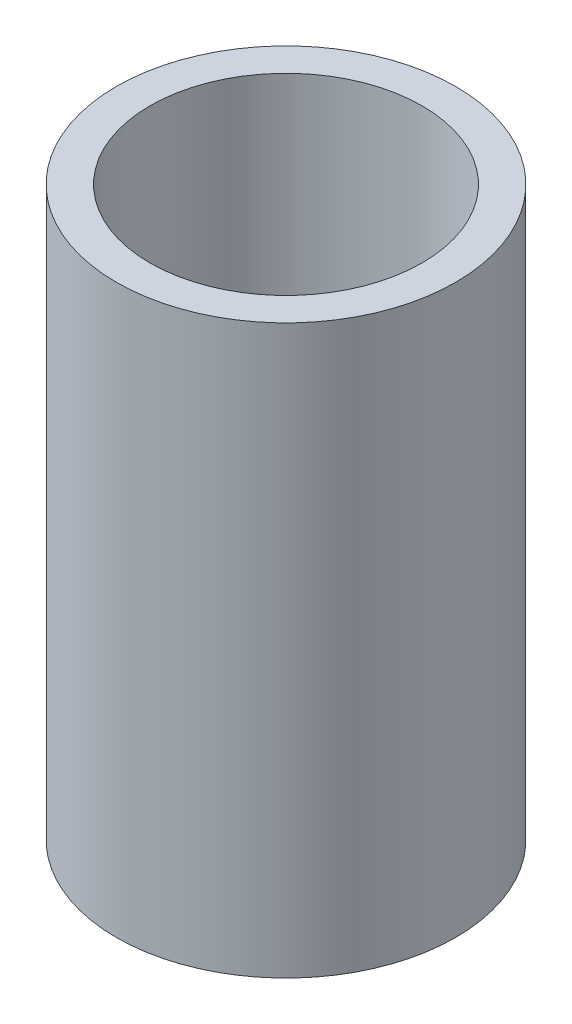
ISO-10303-21;
HEADER;
FILE_DESCRIPTION(('STEP AP214'),'2;1');
FILE_NAME('part.step','',(''),(''),'','','');
FILE_SCHEMA(('AUTOMOTIVE_DESIGN { 1 0 10303 214 1 1 1 1 }'));
ENDSEC;
DATA;
#1=APPLICATION_CONTEXT('core data for automotive mechanical design processes');
#2=APPLICATION_PROTOCOL_DEFINITION('international standard','automotive_design',2000,#1);
#3=PRODUCT_CONTEXT('',#1,'mechanical');
#4=PRODUCT('Part','Part','',(#3));
#5=PRODUCT_RELATED_PRODUCT_CATEGORY('part','',(#4));
#6=PRODUCT_DEFINITION_FORMATION('','',#4);
#7=PRODUCT_DEFINITION_CONTEXT('part definition',#1,'design');
#8=PRODUCT_DEFINITION('design','',#6,#7);
#9=PRODUCT_DEFINITION_SHAPE('','',#8);
#10=(LENGTH_UNIT() NAMED_UNIT(*) SI_UNIT(.MILLI.,.METRE.));
#11=(NAMED_UNIT(*) PLANE_ANGLE_UNIT() SI_UNIT($,.RADIAN.));
#12=(NAMED_UNIT(*) SI_UNIT($,.STERADIAN.) SOLID_ANGLE_UNIT());
#13=UNCERTAINTY_MEASURE_WITH_UNIT(LENGTH_MEASURE(1.E-05),#10,'distance_accuracy_value','');
#14=(GEOMETRIC_REPRESENTATION_CONTEXT(3) GLOBAL_UNCERTAINTY_ASSIGNED_CONTEXT((#13)) GLOBAL_UNIT_ASSIGNED_CONTEXT((#10,
#11,#12)) REPRESENTATION_CONTEXT('',''));
#15=CARTESIAN_POINT('',(0.,0.,0.));
#16=DIRECTION('',(0.,0.,1.));
#17=DIRECTION('',(1.,0.,0.));
#18=AXIS2_PLACEMENT_3D('',#15,#16,#17);
#19=CARTESIAN_POINT('',(0.,58.5398565202642,0.));
#20=DIRECTION('',(0.,-1.,0.));
#21=DIRECTION('',(0.,0.,-1.));
#22=AXIS2_PLACEMENT_3D('',#19,#20,#21);
#23=CYLINDRICAL_SURFACE('',#22,17.5);
#24=CARTESIAN_POINT('',(0.,58.5398565202642,0.));
#25=DIRECTION('',(0.,1.,0.));
#26=DIRECTION('',(0.,0.,1.));
#27=AXIS2_PLACEMENT_3D('',#24,#25,#26);
#28=CIRCLE('',#27,17.5);
#29=CARTESIAN_POINT('',(0.,58.5398565202642,17.5));
#30=VERTEX_POINT('',#29);
#31=EDGE_CURVE('E10',#30,#30,#28,.T.);
#32=ORIENTED_EDGE('',*,*,#31,.F.);
#33=EDGE_LOOP('',(#32));
#34=FACE_BOUND('',#33,.T.);
#35=CARTESIAN_POINT('',(0.,0.,0.));
#36=DIRECTION('',(0.,1.,0.));
#37=DIRECTION('',(0.,0.,1.));
#38=AXIS2_PLACEMENT_3D('',#35,#36,#37);
#39=CIRCLE('',#38,17.5);
#40=CARTESIAN_POINT('',(0.,0.,17.5));
#41=VERTEX_POINT('',#40);
#42=EDGE_CURVE('E37',#41,#41,#39,.T.);
#43=ORIENTED_EDGE('',*,*,#42,.T.);
#44=EDGE_LOOP('',(#43));
#45=FACE_BOUND('',#44,.T.);
#46=ADVANCED_FACE('F40',(#34,#45),#23,.T.);
#47=CARTESIAN_POINT('',(0.,58.5398565202642,0.));
#48=DIRECTION('',(0.,1.,0.));
#49=DIRECTION('',(0.,0.,1.));
#50=AXIS2_PLACEMENT_3D('',#47,#48,#49);
#51=PLANE('',#50);
#52=CARTESIAN_POINT('',(0.,58.5398565202642,0.));
#53=DIRECTION('',(0.,1.,0.));
#54=DIRECTION('',(0.,0.,1.));
#55=AXIS2_PLACEMENT_3D('',#52,#53,#54);
#56=CIRCLE('',#55,14.0399535694748);
#57=CARTESIAN_POINT('',(0.,58.5398565202642,14.0399535694748));
#58=VERTEX_POINT('',#57);
#59=EDGE_CURVE('E50',#58,#58,#56,.T.);
#60=ORIENTED_EDGE('',*,*,#59,.F.);
#61=EDGE_LOOP('',(#60));
#62=FACE_BOUND('',#61,.T.);
#63=ORIENTED_EDGE('',*,*,#31,.T.);
#64=EDGE_LOOP('',(#63));
#65=FACE_BOUND('',#64,.T.);
#66=ADVANCED_FACE('F59',(#62,#65),#51,.T.);
#67=CARTESIAN_POINT('',(0.,0.,0.));
#68=DIRECTION('',(0.,1.,0.));
#69=DIRECTION('',(0.,0.,1.));
#70=AXIS2_PLACEMENT_3D('',#67,#68,#69);
#71=PLANE('',#70);
#72=CARTESIAN_POINT('',(0.,0.,0.));
#73=DIRECTION('',(0.,1.,0.));
#74=DIRECTION('',(0.,0.,1.));
#75=AXIS2_PLACEMENT_3D('',#72,#73,#74);
#76=CIRCLE('',#75,14.0399535694748);
#77=CARTESIAN_POINT('',(0.,0.,14.0399535694748));
#78=VERTEX_POINT('',#77);
#79=EDGE_CURVE('E47',#78,#78,#76,.T.);
#80=ORIENTED_EDGE('',*,*,#79,.T.);
#81=EDGE_LOOP('',(#80));
#82=FACE_BOUND('',#81,.T.);
#83=ORIENTED_EDGE('',*,*,#42,.F.);
#84=EDGE_LOOP('',(#83));
#85=FACE_BOUND('',#84,.T.);
#86=ADVANCED_FACE('F58',(#82,#85),#71,.F.);
#87=CARTESIAN_POINT('',(0.,58.5398565202642,0.));
#88=DIRECTION('',(0.,-1.,0.));
#89=DIRECTION('',(0.,0.,-1.));
#90=AXIS2_PLACEMENT_3D('',#87,#88,#89);
#91=CYLINDRICAL_SURFACE('',#90,14.0399535694748);
#92=ORIENTED_EDGE('',*,*,#59,.T.);
#93=EDGE_LOOP('',(#92));
#94=FACE_BOUND('',#93,.T.);
#95=ORIENTED_EDGE('',*,*,#79,.F.);
#96=EDGE_LOOP('',(#95));
#97=FACE_BOUND('',#96,.T.);
#98=ADVANCED_FACE('F54',(#94,#97),#91,.F.);
#99=CLOSED_SHELL('',(#46,#66,#86,#98));
#100=MANIFOLD_SOLID_BREP('B2',#99);
#101=ADVANCED_BREP_SHAPE_REPRESENTATION('',(#18,#100),#14);
#102=SHAPE_DEFINITION_REPRESENTATION(#9,#101);
ENDSEC;
END-ISO-10303-21;
